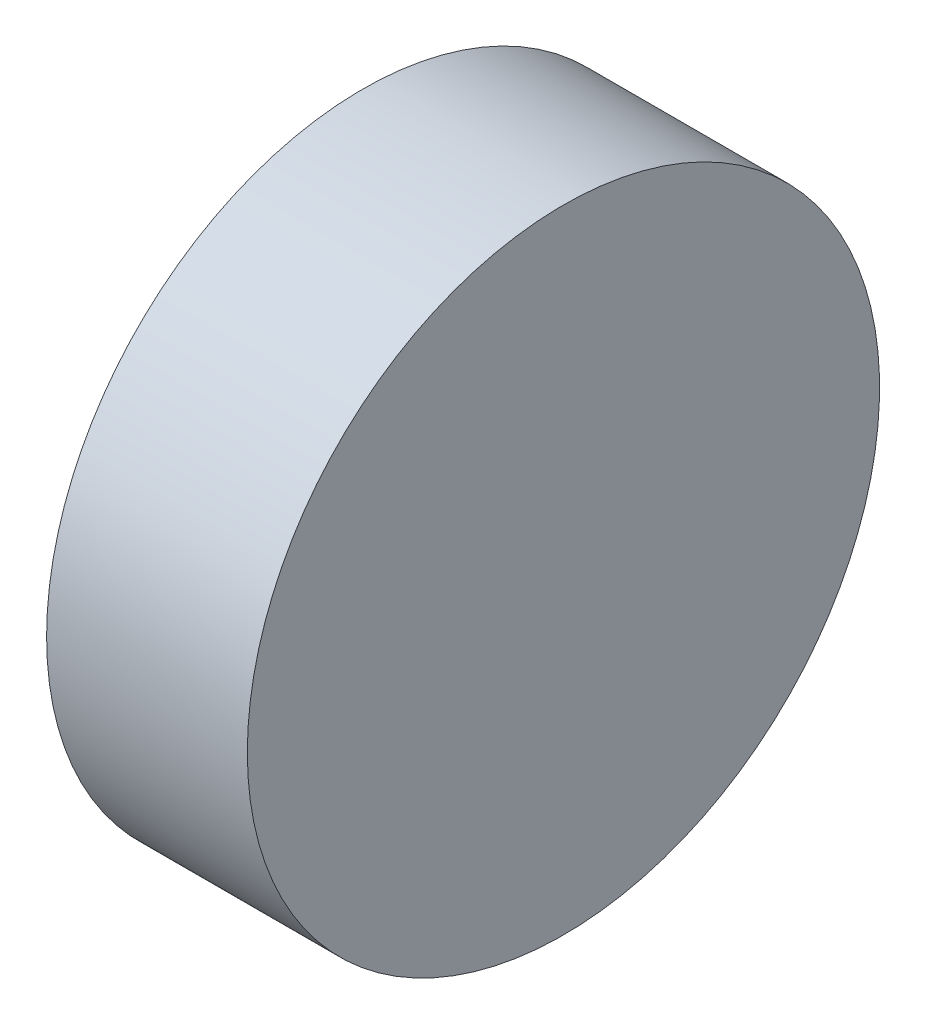
ISO-10303-21;
HEADER;
FILE_DESCRIPTION(('STEP AP214'),'2;1');
FILE_NAME('part.step','',(''),(''),'','','');
FILE_SCHEMA(('AUTOMOTIVE_DESIGN { 1 0 10303 214 1 1 1 1 }'));
ENDSEC;
DATA;
#1=APPLICATION_CONTEXT('core data for automotive mechanical design processes');
#2=APPLICATION_PROTOCOL_DEFINITION('international standard','automotive_design',2000,#1);
#3=PRODUCT_CONTEXT('',#1,'mechanical');
#4=PRODUCT('Part','Part','',(#3));
#5=PRODUCT_RELATED_PRODUCT_CATEGORY('part','',(#4));
#6=PRODUCT_DEFINITION_FORMATION('','',#4);
#7=PRODUCT_DEFINITION_CONTEXT('part definition',#1,'design');
#8=PRODUCT_DEFINITION('design','',#6,#7);
#9=PRODUCT_DEFINITION_SHAPE('','',#8);
#10=(LENGTH_UNIT() NAMED_UNIT(*) SI_UNIT(.MILLI.,.METRE.));
#11=(NAMED_UNIT(*) PLANE_ANGLE_UNIT() SI_UNIT($,.RADIAN.));
#12=(NAMED_UNIT(*) SI_UNIT($,.STERADIAN.) SOLID_ANGLE_UNIT());
#13=UNCERTAINTY_MEASURE_WITH_UNIT(LENGTH_MEASURE(1.E-05),#10,'distance_accuracy_value','');
#14=(GEOMETRIC_REPRESENTATION_CONTEXT(3) GLOBAL_UNCERTAINTY_ASSIGNED_CONTEXT((#13)) GLOBAL_UNIT_ASSIGNED_CONTEXT((#10,
#11,#12)) REPRESENTATION_CONTEXT('',''));
#15=CARTESIAN_POINT('',(0.,0.,0.));
#16=DIRECTION('',(0.,0.,1.));
#17=DIRECTION('',(1.,0.,0.));
#18=AXIS2_PLACEMENT_3D('',#15,#16,#17);
#19=CARTESIAN_POINT('',(51.8879644785289,15.4586358698031,0.));
#20=DIRECTION('',(1.,0.,0.));
#21=DIRECTION('',(0.,0.,-1.));
#22=AXIS2_PLACEMENT_3D('',#19,#20,#21);
#23=PLANE('',#22);
#24=CARTESIAN_POINT('',(51.8879644785289,15.4586358698031,0.));
#25=DIRECTION('',(-1.,0.,0.));
#26=DIRECTION('',(0.,0.,1.));
#27=AXIS2_PLACEMENT_3D('',#24,#25,#26);
#28=CIRCLE('',#27,3.15);
#29=CARTESIAN_POINT('',(51.8879644785289,15.4586358698031,3.15));
#30=VERTEX_POINT('',#29);
#31=EDGE_CURVE('E10',#30,#30,#28,.T.);
#32=ORIENTED_EDGE('',*,*,#31,.T.);
#33=EDGE_LOOP('',(#32));
#34=FACE_BOUND('',#33,.T.);
#35=ADVANCED_FACE('F35',(#34),#23,.F.);
#36=CARTESIAN_POINT('',(50.8001603985232,15.4586358698031,0.));
#37=DIRECTION('',(-1.,0.,0.));
#38=DIRECTION('',(0.,0.,1.));
#39=AXIS2_PLACEMENT_3D('',#36,#37,#38);
#40=CYLINDRICAL_SURFACE('',#39,3.15);
#41=ORIENTED_EDGE('',*,*,#31,.F.);
#42=EDGE_LOOP('',(#41));
#43=FACE_BOUND('',#42,.T.);
#44=CARTESIAN_POINT('',(53.8879644785289,15.4586358698031,0.));
#45=DIRECTION('',(-1.,0.,0.));
#46=DIRECTION('',(0.,0.,1.));
#47=AXIS2_PLACEMENT_3D('',#44,#45,#46);
#48=CIRCLE('',#47,3.15);
#49=CARTESIAN_POINT('',(53.8879644785289,15.4586358698031,3.15));
#50=VERTEX_POINT('',#49);
#51=EDGE_CURVE('E41',#50,#50,#48,.T.);
#52=ORIENTED_EDGE('',*,*,#51,.T.);
#53=EDGE_LOOP('',(#52));
#54=FACE_BOUND('',#53,.T.);
#55=ADVANCED_FACE('F47',(#43,#54),#40,.T.);
#56=CARTESIAN_POINT('',(53.8879644785289,18.6086358698031,0.));
#57=DIRECTION('',(-1.,0.,0.));
#58=DIRECTION('',(0.,0.,1.));
#59=AXIS2_PLACEMENT_3D('',#56,#57,#58);
#60=PLANE('',#59);
#61=ORIENTED_EDGE('',*,*,#51,.F.);
#62=EDGE_LOOP('',(#61));
#63=FACE_BOUND('',#62,.T.);
#64=ADVANCED_FACE('F49',(#63),#60,.F.);
#65=CLOSED_SHELL('',(#35,#55,#64));
#66=MANIFOLD_SOLID_BREP('B2',#65);
#67=ADVANCED_BREP_SHAPE_REPRESENTATION('',(#18,#66),#14);
#68=SHAPE_DEFINITION_REPRESENTATION(#9,#67);
ENDSEC;
END-ISO-10303-21;
